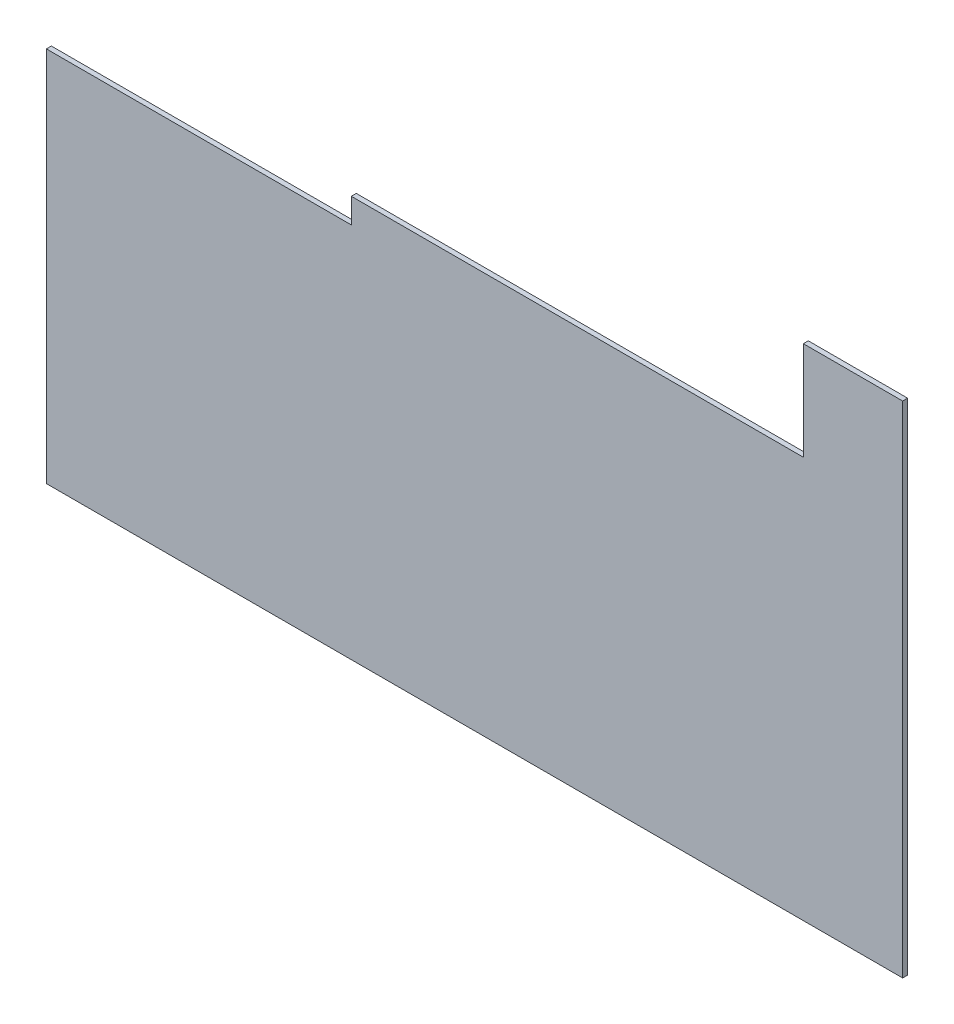
ISO-10303-21;
HEADER;
FILE_DESCRIPTION(('STEP AP214'),'2;1');
FILE_NAME('part.step','',(''),(''),'','','');
FILE_SCHEMA(('AUTOMOTIVE_DESIGN { 1 0 10303 214 1 1 1 1 }'));
ENDSEC;
DATA;
#1=APPLICATION_CONTEXT('core data for automotive mechanical design processes');
#2=APPLICATION_PROTOCOL_DEFINITION('international standard','automotive_design',2000,#1);
#3=PRODUCT_CONTEXT('',#1,'mechanical');
#4=PRODUCT('Part','Part','',(#3));
#5=PRODUCT_RELATED_PRODUCT_CATEGORY('part','',(#4));
#6=PRODUCT_DEFINITION_FORMATION('','',#4);
#7=PRODUCT_DEFINITION_CONTEXT('part definition',#1,'design');
#8=PRODUCT_DEFINITION('design','',#6,#7);
#9=PRODUCT_DEFINITION_SHAPE('','',#8);
#10=(LENGTH_UNIT() NAMED_UNIT(*) SI_UNIT(.MILLI.,.METRE.));
#11=(NAMED_UNIT(*) PLANE_ANGLE_UNIT() SI_UNIT($,.RADIAN.));
#12=(NAMED_UNIT(*) SI_UNIT($,.STERADIAN.) SOLID_ANGLE_UNIT());
#13=UNCERTAINTY_MEASURE_WITH_UNIT(LENGTH_MEASURE(1.E-05),#10,'distance_accuracy_value','');
#14=(GEOMETRIC_REPRESENTATION_CONTEXT(3) GLOBAL_UNCERTAINTY_ASSIGNED_CONTEXT((#13)) GLOBAL_UNIT_ASSIGNED_CONTEXT((#10,
#11,#12)) REPRESENTATION_CONTEXT('',''));
#15=CARTESIAN_POINT('',(0.,0.,0.));
#16=DIRECTION('',(0.,0.,1.));
#17=DIRECTION('',(1.,0.,0.));
#18=AXIS2_PLACEMENT_3D('',#15,#16,#17);
#19=CARTESIAN_POINT('',(6002.,0.,-25.));
#20=DIRECTION('',(0.,-1.,0.));
#21=DIRECTION('',(1.,0.,0.));
#22=AXIS2_PLACEMENT_3D('',#19,#20,#21);
#23=PLANE('',#22);
#24=DIRECTION('',(0.,0.,1.));
#25=VECTOR('',#24,1.);
#26=CARTESIAN_POINT('',(5710.,0.,-25.));
#27=LINE('',#26,#25);
#28=CARTESIAN_POINT('',(5710.,0.,-25.));
#29=VERTEX_POINT('',#28);
#30=CARTESIAN_POINT('',(5710.,0.,0.));
#31=VERTEX_POINT('',#30);
#32=EDGE_CURVE('E104',#29,#31,#27,.T.);
#33=ORIENTED_EDGE('',*,*,#32,.T.);
#34=DIRECTION('',(1.,0.,0.));
#35=VECTOR('',#34,1.);
#36=CARTESIAN_POINT('',(6002.,0.,0.));
#37=LINE('',#36,#35);
#38=CARTESIAN_POINT('',(1400.,0.,0.));
#39=VERTEX_POINT('',#38);
#40=EDGE_CURVE('E138',#39,#31,#37,.T.);
#41=ORIENTED_EDGE('',*,*,#40,.F.);
#42=DIRECTION('',(0.,0.,1.));
#43=VECTOR('',#42,1.);
#44=CARTESIAN_POINT('',(1400.,0.,-25.));
#45=LINE('',#44,#43);
#46=CARTESIAN_POINT('',(1400.,0.,-25.));
#47=VERTEX_POINT('',#46);
#48=EDGE_CURVE('E61',#47,#39,#45,.T.);
#49=ORIENTED_EDGE('',*,*,#48,.F.);
#50=DIRECTION('',(1.,0.,0.));
#51=VECTOR('',#50,1.);
#52=CARTESIAN_POINT('',(6002.,0.,-25.));
#53=LINE('',#52,#51);
#54=EDGE_CURVE('E123',#47,#29,#53,.T.);
#55=ORIENTED_EDGE('',*,*,#54,.T.);
#56=EDGE_LOOP('',(#33,#41,#49,#55));
#57=FACE_BOUND('',#56,.T.);
#58=ADVANCED_FACE('F40',(#57),#23,.T.);
#59=CARTESIAN_POINT('',(2935.,1895.,-25.));
#60=DIRECTION('',(0.,1.,0.));
#61=DIRECTION('',(0.,0.,1.));
#62=AXIS2_PLACEMENT_3D('',#59,#60,#61);
#63=PLANE('',#62);
#64=DIRECTION('',(0.,0.,1.));
#65=VECTOR('',#64,1.);
#66=CARTESIAN_POINT('',(1400.,1895.,-25.));
#67=LINE('',#66,#65);
#68=CARTESIAN_POINT('',(1400.,1895.,-25.));
#69=VERTEX_POINT('',#68);
#70=CARTESIAN_POINT('',(1400.,1895.,0.));
#71=VERTEX_POINT('',#70);
#72=EDGE_CURVE('E141',#69,#71,#67,.T.);
#73=ORIENTED_EDGE('',*,*,#72,.T.);
#74=DIRECTION('',(-1.,0.,0.));
#75=VECTOR('',#74,1.);
#76=CARTESIAN_POINT('',(2935.,1895.,0.));
#77=LINE('',#76,#75);
#78=CARTESIAN_POINT('',(2935.,1895.,0.));
#79=VERTEX_POINT('',#78);
#80=EDGE_CURVE('E128',#79,#71,#77,.T.);
#81=ORIENTED_EDGE('',*,*,#80,.F.);
#82=DIRECTION('',(0.,0.,1.));
#83=VECTOR('',#82,1.);
#84=CARTESIAN_POINT('',(2935.,1895.,-25.));
#85=LINE('',#84,#83);
#86=CARTESIAN_POINT('',(2935.,1895.,-25.));
#87=VERTEX_POINT('',#86);
#88=EDGE_CURVE('E151',#87,#79,#85,.T.);
#89=ORIENTED_EDGE('',*,*,#88,.F.);
#90=DIRECTION('',(-1.,0.,0.));
#91=VECTOR('',#90,1.);
#92=CARTESIAN_POINT('',(2935.,1895.,-25.));
#93=LINE('',#92,#91);
#94=EDGE_CURVE('E134',#87,#69,#93,.T.);
#95=ORIENTED_EDGE('',*,*,#94,.T.);
#96=EDGE_LOOP('',(#73,#81,#89,#95));
#97=FACE_BOUND('',#96,.T.);
#98=ADVANCED_FACE('F185',(#97),#63,.T.);
#99=CARTESIAN_POINT('',(2935.,2020.,-25.));
#100=DIRECTION('',(-1.,0.,0.));
#101=DIRECTION('',(0.,0.,1.));
#102=AXIS2_PLACEMENT_3D('',#99,#100,#101);
#103=PLANE('',#102);
#104=DIRECTION('',(0.,-1.,0.));
#105=VECTOR('',#104,1.);
#106=CARTESIAN_POINT('',(2935.,2020.,0.));
#107=LINE('',#106,#105);
#108=CARTESIAN_POINT('',(2935.,2020.,0.));
#109=VERTEX_POINT('',#108);
#110=EDGE_CURVE('E146',#109,#79,#107,.T.);
#111=ORIENTED_EDGE('',*,*,#110,.F.);
#112=DIRECTION('',(0.,0.,1.));
#113=VECTOR('',#112,1.);
#114=CARTESIAN_POINT('',(2935.,2020.,-25.));
#115=LINE('',#114,#113);
#116=CARTESIAN_POINT('',(2935.,2020.,-25.));
#117=VERTEX_POINT('',#116);
#118=EDGE_CURVE('E137',#117,#109,#115,.T.);
#119=ORIENTED_EDGE('',*,*,#118,.F.);
#120=DIRECTION('',(0.,-1.,0.));
#121=VECTOR('',#120,1.);
#122=CARTESIAN_POINT('',(2935.,2020.,-25.));
#123=LINE('',#122,#121);
#124=EDGE_CURVE('E126',#117,#87,#123,.T.);
#125=ORIENTED_EDGE('',*,*,#124,.T.);
#126=ORIENTED_EDGE('',*,*,#88,.T.);
#127=EDGE_LOOP('',(#111,#119,#125,#126));
#128=FACE_BOUND('',#127,.T.);
#129=ADVANCED_FACE('F182',(#128),#103,.T.);
#130=CARTESIAN_POINT('',(2935.,2020.,-25.));
#131=DIRECTION('',(0.,1.,0.));
#132=DIRECTION('',(0.,0.,1.));
#133=AXIS2_PLACEMENT_3D('',#130,#131,#132);
#134=PLANE('',#133);
#135=DIRECTION('',(-1.,0.,0.));
#136=VECTOR('',#135,1.);
#137=CARTESIAN_POINT('',(2935.,2020.,0.));
#138=LINE('',#137,#136);
#139=CARTESIAN_POINT('',(5210.,2020.,0.));
#140=VERTEX_POINT('',#139);
#141=EDGE_CURVE('E143',#140,#109,#138,.T.);
#142=ORIENTED_EDGE('',*,*,#141,.F.);
#143=DIRECTION('',(0.,0.,1.));
#144=VECTOR('',#143,1.);
#145=CARTESIAN_POINT('',(5210.,2020.,-25.));
#146=LINE('',#145,#144);
#147=CARTESIAN_POINT('',(5210.,2020.,-25.));
#148=VERTEX_POINT('',#147);
#149=EDGE_CURVE('E163',#148,#140,#146,.T.);
#150=ORIENTED_EDGE('',*,*,#149,.F.);
#151=DIRECTION('',(-1.,0.,0.));
#152=VECTOR('',#151,1.);
#153=CARTESIAN_POINT('',(2935.,2020.,-25.));
#154=LINE('',#153,#152);
#155=EDGE_CURVE('E122',#148,#117,#154,.T.);
#156=ORIENTED_EDGE('',*,*,#155,.T.);
#157=ORIENTED_EDGE('',*,*,#118,.T.);
#158=EDGE_LOOP('',(#142,#150,#156,#157));
#159=FACE_BOUND('',#158,.T.);
#160=ADVANCED_FACE('F179',(#159),#134,.T.);
#161=CARTESIAN_POINT('',(4900.,2515.,-25.));
#162=DIRECTION('',(0.,1.,0.));
#163=DIRECTION('',(0.,0.,1.));
#164=AXIS2_PLACEMENT_3D('',#161,#162,#163);
#165=PLANE('',#164);
#166=DIRECTION('',(0.,0.,1.));
#167=VECTOR('',#166,1.);
#168=CARTESIAN_POINT('',(5710.,2515.,-25.));
#169=LINE('',#168,#167);
#170=CARTESIAN_POINT('',(5710.,2515.,-25.));
#171=VERTEX_POINT('',#170);
#172=CARTESIAN_POINT('',(5710.,2515.,0.));
#173=VERTEX_POINT('',#172);
#174=EDGE_CURVE('E54',#171,#173,#169,.T.);
#175=ORIENTED_EDGE('',*,*,#174,.F.);
#176=DIRECTION('',(-1.,0.,0.));
#177=VECTOR('',#176,1.);
#178=CARTESIAN_POINT('',(4900.,2515.,-25.));
#179=LINE('',#178,#177);
#180=CARTESIAN_POINT('',(5210.,2515.,-25.));
#181=VERTEX_POINT('',#180);
#182=EDGE_CURVE('E114',#171,#181,#179,.T.);
#183=ORIENTED_EDGE('',*,*,#182,.T.);
#184=DIRECTION('',(0.,0.,1.));
#185=VECTOR('',#184,1.);
#186=CARTESIAN_POINT('',(5210.,2515.,-25.));
#187=LINE('',#186,#185);
#188=CARTESIAN_POINT('',(5210.,2515.,0.));
#189=VERTEX_POINT('',#188);
#190=EDGE_CURVE('E169',#181,#189,#187,.T.);
#191=ORIENTED_EDGE('',*,*,#190,.T.);
#192=DIRECTION('',(-1.,0.,0.));
#193=VECTOR('',#192,1.);
#194=CARTESIAN_POINT('',(4900.,2515.,0.));
#195=LINE('',#194,#193);
#196=EDGE_CURVE('E116',#173,#189,#195,.T.);
#197=ORIENTED_EDGE('',*,*,#196,.F.);
#198=EDGE_LOOP('',(#175,#183,#191,#197));
#199=FACE_BOUND('',#198,.T.);
#200=ADVANCED_FACE('F112',(#199),#165,.T.);
#201=CARTESIAN_POINT('',(0.,0.,-25.));
#202=DIRECTION('',(0.,0.,-1.));
#203=DIRECTION('',(-1.,0.,0.));
#204=AXIS2_PLACEMENT_3D('',#201,#202,#203);
#205=PLANE('',#204);
#206=DIRECTION('',(0.,-1.,0.));
#207=VECTOR('',#206,1.);
#208=CARTESIAN_POINT('',(5710.,2515.,-25.));
#209=LINE('',#208,#207);
#210=EDGE_CURVE('E101',#171,#29,#209,.T.);
#211=ORIENTED_EDGE('',*,*,#210,.T.);
#212=ORIENTED_EDGE('',*,*,#54,.F.);
#213=DIRECTION('',(0.,1.,0.));
#214=VECTOR('',#213,1.);
#215=CARTESIAN_POINT('',(1400.,1895.,-25.));
#216=LINE('',#215,#214);
#217=EDGE_CURVE('E166',#47,#69,#216,.T.);
#218=ORIENTED_EDGE('',*,*,#217,.T.);
#219=ORIENTED_EDGE('',*,*,#94,.F.);
#220=ORIENTED_EDGE('',*,*,#124,.F.);
#221=ORIENTED_EDGE('',*,*,#155,.F.);
#222=DIRECTION('',(0.,1.,0.));
#223=VECTOR('',#222,1.);
#224=CARTESIAN_POINT('',(5210.,2515.,-25.));
#225=LINE('',#224,#223);
#226=EDGE_CURVE('E121',#148,#181,#225,.T.);
#227=ORIENTED_EDGE('',*,*,#226,.T.);
#228=ORIENTED_EDGE('',*,*,#182,.F.);
#229=EDGE_LOOP('',(#211,#212,#218,#219,#220,#221,#227,#228));
#230=FACE_BOUND('',#229,.T.);
#231=ADVANCED_FACE('F119',(#230),#205,.T.);
#232=CARTESIAN_POINT('',(0.,0.,0.));
#233=DIRECTION('',(0.,0.,-1.));
#234=DIRECTION('',(-1.,0.,0.));
#235=AXIS2_PLACEMENT_3D('',#232,#233,#234);
#236=PLANE('',#235);
#237=ORIENTED_EDGE('',*,*,#40,.T.);
#238=DIRECTION('',(0.,1.,0.));
#239=VECTOR('',#238,1.);
#240=CARTESIAN_POINT('',(5710.,0.,0.));
#241=LINE('',#240,#239);
#242=EDGE_CURVE('E11',#31,#173,#241,.T.);
#243=ORIENTED_EDGE('',*,*,#242,.T.);
#244=ORIENTED_EDGE('',*,*,#196,.T.);
#245=DIRECTION('',(0.,-1.,0.));
#246=VECTOR('',#245,1.);
#247=CARTESIAN_POINT('',(5210.,0.,0.));
#248=LINE('',#247,#246);
#249=EDGE_CURVE('E153',#189,#140,#248,.T.);
#250=ORIENTED_EDGE('',*,*,#249,.T.);
#251=ORIENTED_EDGE('',*,*,#141,.T.);
#252=ORIENTED_EDGE('',*,*,#110,.T.);
#253=ORIENTED_EDGE('',*,*,#80,.T.);
#254=DIRECTION('',(0.,-1.,0.));
#255=VECTOR('',#254,1.);
#256=CARTESIAN_POINT('',(1400.,1.64043507596329E-13,0.));
#257=LINE('',#256,#255);
#258=EDGE_CURVE('E47',#71,#39,#257,.T.);
#259=ORIENTED_EDGE('',*,*,#258,.T.);
#260=EDGE_LOOP('',(#237,#243,#244,#250,#251,#252,#253,#259));
#261=FACE_BOUND('',#260,.T.);
#262=ADVANCED_FACE('F158',(#261),#236,.F.);
#263=CARTESIAN_POINT('',(5210.,2515.,-25.));
#264=DIRECTION('',(1.,0.,0.));
#265=DIRECTION('',(0.,0.,-1.));
#266=AXIS2_PLACEMENT_3D('',#263,#264,#265);
#267=PLANE('',#266);
#268=ORIENTED_EDGE('',*,*,#190,.F.);
#269=ORIENTED_EDGE('',*,*,#226,.F.);
#270=ORIENTED_EDGE('',*,*,#149,.T.);
#271=ORIENTED_EDGE('',*,*,#249,.F.);
#272=EDGE_LOOP('',(#268,#269,#270,#271));
#273=FACE_BOUND('',#272,.T.);
#274=ADVANCED_FACE('F176',(#273),#267,.F.);
#275=CARTESIAN_POINT('',(1400.,1895.,-25.));
#276=DIRECTION('',(1.,0.,0.));
#277=DIRECTION('',(0.,1.,0.));
#278=AXIS2_PLACEMENT_3D('',#275,#276,#277);
#279=PLANE('',#278);
#280=ORIENTED_EDGE('',*,*,#72,.F.);
#281=ORIENTED_EDGE('',*,*,#217,.F.);
#282=ORIENTED_EDGE('',*,*,#48,.T.);
#283=ORIENTED_EDGE('',*,*,#258,.F.);
#284=EDGE_LOOP('',(#280,#281,#282,#283));
#285=FACE_BOUND('',#284,.T.);
#286=ADVANCED_FACE('F186',(#285),#279,.F.);
#287=CARTESIAN_POINT('',(5710.,2515.,-25.));
#288=DIRECTION('',(-1.,0.,0.));
#289=DIRECTION('',(0.,0.,1.));
#290=AXIS2_PLACEMENT_3D('',#287,#288,#289);
#291=PLANE('',#290);
#292=ORIENTED_EDGE('',*,*,#32,.F.);
#293=ORIENTED_EDGE('',*,*,#210,.F.);
#294=ORIENTED_EDGE('',*,*,#174,.T.);
#295=ORIENTED_EDGE('',*,*,#242,.F.);
#296=EDGE_LOOP('',(#292,#293,#294,#295));
#297=FACE_BOUND('',#296,.T.);
#298=ADVANCED_FACE('F102',(#297),#291,.F.);
#299=CLOSED_SHELL('',(#58,#98,#129,#160,#200,#231,#262,#274,#286,#298));
#300=MANIFOLD_SOLID_BREP('B2',#299);
#301=ADVANCED_BREP_SHAPE_REPRESENTATION('',(#18,#300),#14);
#302=SHAPE_DEFINITION_REPRESENTATION(#9,#301);
ENDSEC;
END-ISO-10303-21;
